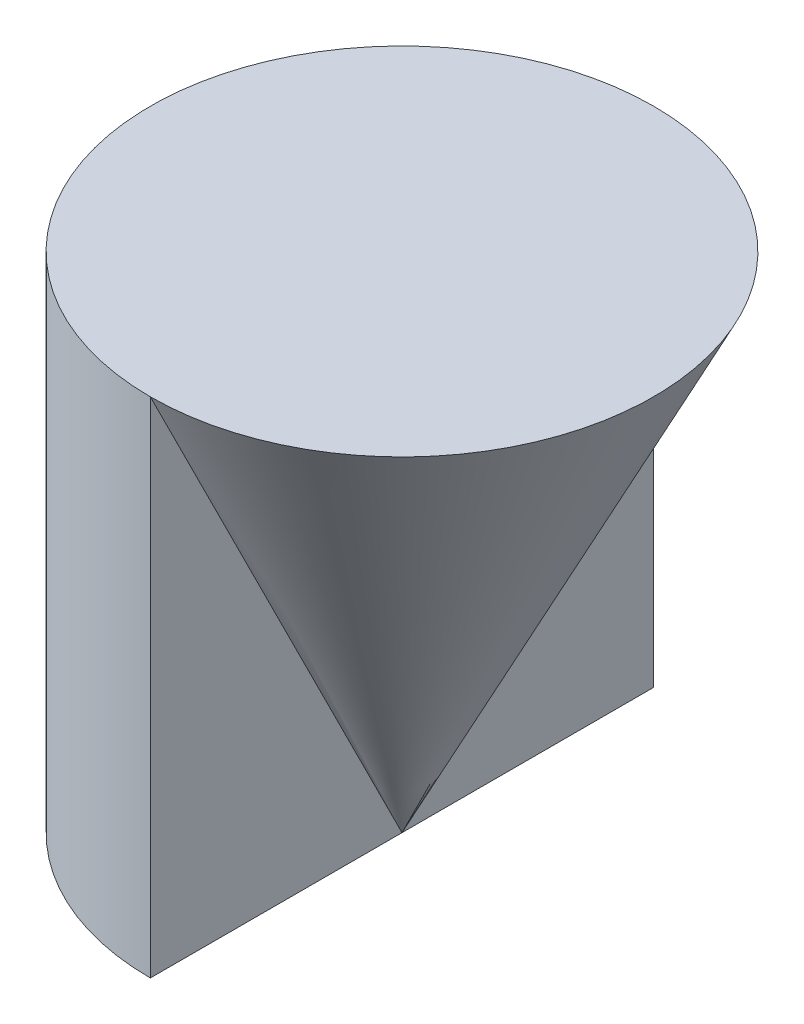
ISO-10303-21;
HEADER;
FILE_DESCRIPTION(('STEP AP214'),'2;1');
FILE_NAME('part.step','',(''),(''),'','','');
FILE_SCHEMA(('AUTOMOTIVE_DESIGN { 1 0 10303 214 1 1 1 1 }'));
ENDSEC;
DATA;
#1=APPLICATION_CONTEXT('core data for automotive mechanical design processes');
#2=APPLICATION_PROTOCOL_DEFINITION('international standard','automotive_design',2000,#1);
#3=PRODUCT_CONTEXT('',#1,'mechanical');
#4=PRODUCT('Part','Part','',(#3));
#5=PRODUCT_RELATED_PRODUCT_CATEGORY('part','',(#4));
#6=PRODUCT_DEFINITION_FORMATION('','',#4);
#7=PRODUCT_DEFINITION_CONTEXT('part definition',#1,'design');
#8=PRODUCT_DEFINITION('design','',#6,#7);
#9=PRODUCT_DEFINITION_SHAPE('','',#8);
#10=(LENGTH_UNIT() NAMED_UNIT(*) SI_UNIT(.MILLI.,.METRE.));
#11=(NAMED_UNIT(*) PLANE_ANGLE_UNIT() SI_UNIT($,.RADIAN.));
#12=(NAMED_UNIT(*) SI_UNIT($,.STERADIAN.) SOLID_ANGLE_UNIT());
#13=UNCERTAINTY_MEASURE_WITH_UNIT(LENGTH_MEASURE(1.E-05),#10,'distance_accuracy_value','');
#14=(GEOMETRIC_REPRESENTATION_CONTEXT(3) GLOBAL_UNCERTAINTY_ASSIGNED_CONTEXT((#13)) GLOBAL_UNIT_ASSIGNED_CONTEXT((#10,
#11,#12)) REPRESENTATION_CONTEXT('',''));
#15=CARTESIAN_POINT('',(0.,0.,0.));
#16=DIRECTION('',(0.,0.,1.));
#17=DIRECTION('',(1.,0.,0.));
#18=AXIS2_PLACEMENT_3D('',#15,#16,#17);
#19=CARTESIAN_POINT('',(0.,4.,-2.));
#20=DIRECTION('',(-1.,0.,0.));
#21=DIRECTION('',(0.,0.,1.));
#22=AXIS2_PLACEMENT_3D('',#19,#20,#21);
#23=PLANE('',#22);
#24=DIRECTION('',(0.,0.894427190999916,0.447213595499958));
#25=VECTOR('',#24,1.);
#26=CARTESIAN_POINT('',(0.,0.,0.));
#27=LINE('',#26,#25);
#28=CARTESIAN_POINT('',(0.,0.,0.));
#29=VERTEX_POINT('',#28);
#30=CARTESIAN_POINT('',(0.,4.,2.));
#31=VERTEX_POINT('',#30);
#32=EDGE_CURVE('E65',#29,#31,#27,.T.);
#33=ORIENTED_EDGE('',*,*,#32,.T.);
#34=DIRECTION('',(0.,-1.,0.));
#35=VECTOR('',#34,1.);
#36=CARTESIAN_POINT('',(0.,4.,2.));
#37=LINE('',#36,#35);
#38=CARTESIAN_POINT('',(0.,0.,2.));
#39=VERTEX_POINT('',#38);
#40=EDGE_CURVE('E11',#31,#39,#37,.T.);
#41=ORIENTED_EDGE('',*,*,#40,.T.);
#42=DIRECTION('',(0.,0.,-1.));
#43=VECTOR('',#42,1.);
#44=CARTESIAN_POINT('',(0.,0.,-2.));
#45=LINE('',#44,#43);
#46=EDGE_CURVE('E61',#39,#29,#45,.T.);
#47=ORIENTED_EDGE('',*,*,#46,.T.);
#48=EDGE_LOOP('',(#33,#41,#47));
#49=FACE_BOUND('',#48,.T.);
#50=ADVANCED_FACE('F33',(#49),#23,.F.);
#51=DIRECTION('',(0.,0.894427190999916,-0.447213595499958));
#52=VECTOR('',#51,1.);
#53=CARTESIAN_POINT('',(0.,0.,0.));
#54=LINE('',#53,#52);
#55=CARTESIAN_POINT('',(0.,4.,-2.));
#56=VERTEX_POINT('',#55);
#57=EDGE_CURVE('E49',#29,#56,#54,.T.);
#58=ORIENTED_EDGE('',*,*,#57,.F.);
#59=CARTESIAN_POINT('',(0.,0.,-2.));
#60=VERTEX_POINT('',#59);
#61=EDGE_CURVE('E73',#29,#60,#45,.T.);
#62=ORIENTED_EDGE('',*,*,#61,.T.);
#63=DIRECTION('',(0.,-1.,0.));
#64=VECTOR('',#63,1.);
#65=CARTESIAN_POINT('',(0.,4.,-2.));
#66=LINE('',#65,#64);
#67=EDGE_CURVE('E42',#56,#60,#66,.T.);
#68=ORIENTED_EDGE('',*,*,#67,.F.);
#69=EDGE_LOOP('',(#58,#62,#68));
#70=FACE_BOUND('',#69,.T.);
#71=ADVANCED_FACE('F72',(#70),#23,.F.);
#72=CARTESIAN_POINT('',(0.,4.,0.));
#73=DIRECTION('',(0.,-1.,0.));
#74=DIRECTION('',(0.,0.,-1.));
#75=AXIS2_PLACEMENT_3D('',#72,#73,#74);
#76=CYLINDRICAL_SURFACE('',#75,2.);
#77=CARTESIAN_POINT('',(0.,0.,0.));
#78=DIRECTION('',(0.,1.,0.));
#79=DIRECTION('',(0.,0.,1.));
#80=AXIS2_PLACEMENT_3D('',#77,#78,#79);
#81=CIRCLE('',#80,2.);
#82=EDGE_CURVE('E79',#60,#39,#81,.T.);
#83=ORIENTED_EDGE('',*,*,#82,.T.);
#84=ORIENTED_EDGE('',*,*,#40,.F.);
#85=CARTESIAN_POINT('',(0.,4.,0.));
#86=DIRECTION('',(0.,1.,0.));
#87=DIRECTION('',(0.,0.,1.));
#88=AXIS2_PLACEMENT_3D('',#85,#86,#87);
#89=CIRCLE('',#88,2.);
#90=EDGE_CURVE('E82',#56,#31,#89,.T.);
#91=ORIENTED_EDGE('',*,*,#90,.F.);
#92=ORIENTED_EDGE('',*,*,#67,.T.);
#93=EDGE_LOOP('',(#83,#84,#91,#92));
#94=FACE_BOUND('',#93,.T.);
#95=ADVANCED_FACE('F35',(#94),#76,.T.);
#96=CARTESIAN_POINT('',(0.,4.,0.));
#97=DIRECTION('',(0.,1.,0.));
#98=DIRECTION('',(0.,0.,1.));
#99=AXIS2_PLACEMENT_3D('',#96,#97,#98);
#100=PLANE('',#99);
#101=ORIENTED_EDGE('',*,*,#90,.T.);
#102=CARTESIAN_POINT('',(0.,4.,0.));
#103=DIRECTION('',(0.,1.,0.));
#104=DIRECTION('',(0.,0.,1.));
#105=AXIS2_PLACEMENT_3D('',#102,#103,#104);
#106=CIRCLE('',#105,2.);
#107=EDGE_CURVE('E63',#31,#56,#106,.T.);
#108=ORIENTED_EDGE('',*,*,#107,.T.);
#109=EDGE_LOOP('',(#101,#108));
#110=FACE_BOUND('',#109,.T.);
#111=ADVANCED_FACE('F87',(#110),#100,.T.);
#112=CARTESIAN_POINT('',(0.,0.,0.));
#113=DIRECTION('',(0.,1.,0.));
#114=DIRECTION('',(0.,0.,1.));
#115=AXIS2_PLACEMENT_3D('',#112,#113,#114);
#116=PLANE('',#115);
#117=ORIENTED_EDGE('',*,*,#82,.F.);
#118=ORIENTED_EDGE('',*,*,#61,.F.);
#119=ORIENTED_EDGE('',*,*,#46,.F.);
#120=EDGE_LOOP('',(#117,#118,#119));
#121=FACE_BOUND('',#120,.T.);
#122=ADVANCED_FACE('F77',(#121),#116,.F.);
#123=CARTESIAN_POINT('',(0.,0.,0.));
#124=DIRECTION('',(0.,1.,0.));
#125=DIRECTION('',(0.,0.,1.));
#126=AXIS2_PLACEMENT_3D('',#123,#124,#125);
#127=CONICAL_SURFACE('',#126,0.,0.463647609000806);
#128=ORIENTED_EDGE('',*,*,#32,.F.);
#129=ORIENTED_EDGE('',*,*,#57,.T.);
#130=ORIENTED_EDGE('',*,*,#107,.F.);
#131=EDGE_LOOP('',(#128,#129,#130));
#132=FACE_BOUND('',#131,.T.);
#133=ADVANCED_FACE('F66',(#132),#127,.T.);
#134=CLOSED_SHELL('',(#50,#71,#95,#111,#122,#133));
#135=MANIFOLD_SOLID_BREP('B2',#134);
#136=ADVANCED_BREP_SHAPE_REPRESENTATION('',(#18,#135),#14);
#137=SHAPE_DEFINITION_REPRESENTATION(#9,#136);
ENDSEC;
END-ISO-10303-21;
